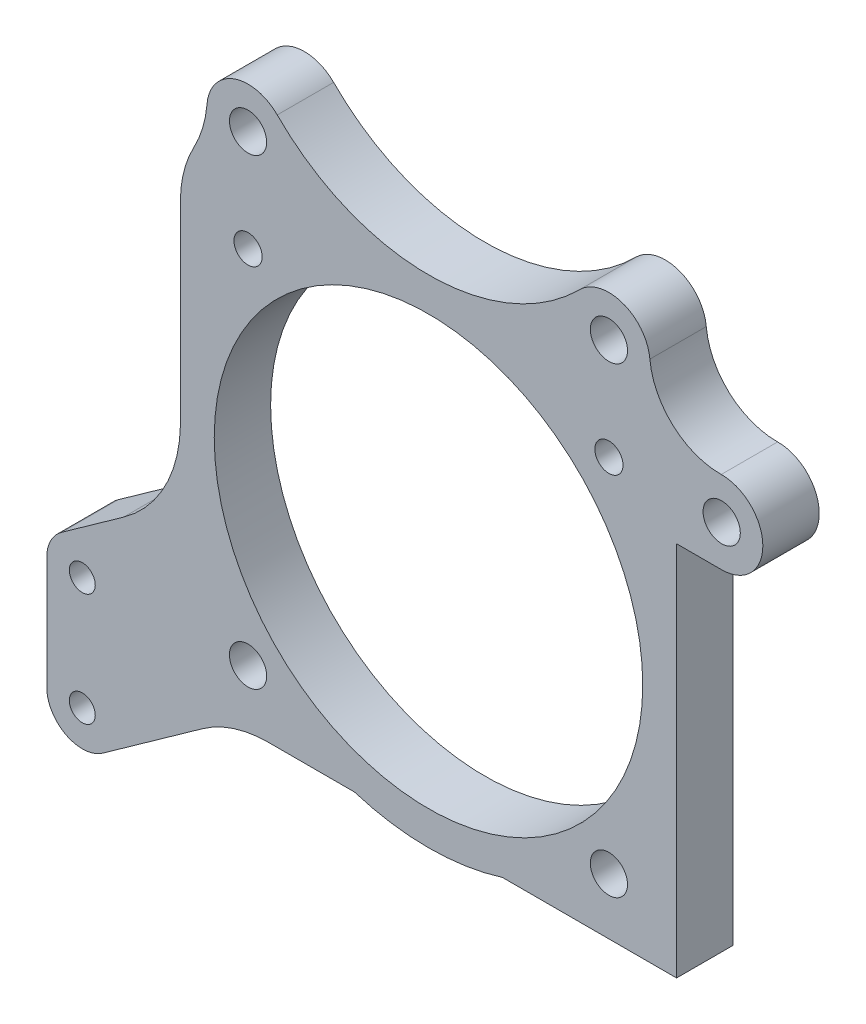
ISO-10303-21;
HEADER;
FILE_DESCRIPTION(('STEP AP214'),'2;1');
FILE_NAME('part.step','',(''),(''),'','','');
FILE_SCHEMA(('AUTOMOTIVE_DESIGN { 1 0 10303 214 1 1 1 1 }'));
ENDSEC;
DATA;
#1=APPLICATION_CONTEXT('core data for automotive mechanical design processes');
#2=APPLICATION_PROTOCOL_DEFINITION('international standard','automotive_design',2000,#1);
#3=PRODUCT_CONTEXT('',#1,'mechanical');
#4=PRODUCT('Part','Part','',(#3));
#5=PRODUCT_RELATED_PRODUCT_CATEGORY('part','',(#4));
#6=PRODUCT_DEFINITION_FORMATION('','',#4);
#7=PRODUCT_DEFINITION_CONTEXT('part definition',#1,'design');
#8=PRODUCT_DEFINITION('design','',#6,#7);
#9=PRODUCT_DEFINITION_SHAPE('','',#8);
#10=(LENGTH_UNIT() NAMED_UNIT(*) SI_UNIT(.MILLI.,.METRE.));
#11=(NAMED_UNIT(*) PLANE_ANGLE_UNIT() SI_UNIT($,.RADIAN.));
#12=(NAMED_UNIT(*) SI_UNIT($,.STERADIAN.) SOLID_ANGLE_UNIT());
#13=UNCERTAINTY_MEASURE_WITH_UNIT(LENGTH_MEASURE(1.E-05),#10,'distance_accuracy_value','');
#14=(GEOMETRIC_REPRESENTATION_CONTEXT(3) GLOBAL_UNCERTAINTY_ASSIGNED_CONTEXT((#13)) GLOBAL_UNIT_ASSIGNED_CONTEXT((#10,
#11,#12)) REPRESENTATION_CONTEXT('',''));
#15=CARTESIAN_POINT('',(0.,0.,0.));
#16=DIRECTION('',(0.,0.,1.));
#17=DIRECTION('',(1.,0.,0.));
#18=AXIS2_PLACEMENT_3D('',#15,#16,#17);
#19=CARTESIAN_POINT('',(-20.2380952380952,-21.,45.7173028644093));
#20=DIRECTION('',(-1.,0.,0.));
#21=DIRECTION('',(0.,0.,1.));
#22=AXIS2_PLACEMENT_3D('',#19,#20,#21);
#23=PLANE('',#22);
#24=DIRECTION('',(0.,1.,0.));
#25=VECTOR('',#24,1.);
#26=CARTESIAN_POINT('',(-20.2380952380952,-21.,0.));
#27=LINE('',#26,#25);
#28=CARTESIAN_POINT('',(-20.2380952380952,-0.558456175241286,0.));
#29=VERTEX_POINT('',#28);
#30=CARTESIAN_POINT('',(-20.2380952380952,16.6503890181125,0.));
#31=VERTEX_POINT('',#30);
#32=EDGE_CURVE('E228',#29,#31,#27,.T.);
#33=ORIENTED_EDGE('',*,*,#32,.F.);
#34=DIRECTION('',(0.,0.,1.));
#35=VECTOR('',#34,1.);
#36=CARTESIAN_POINT('',(-20.2380952380952,-0.558456175241278,-35.1845806434157));
#37=LINE('',#36,#35);
#38=CARTESIAN_POINT('',(-20.2380952380952,-0.558456175241278,5.));
#39=VERTEX_POINT('',#38);
#40=EDGE_CURVE('E53',#29,#39,#37,.T.);
#41=ORIENTED_EDGE('',*,*,#40,.T.);
#42=DIRECTION('',(0.,1.,0.));
#43=VECTOR('',#42,1.);
#44=CARTESIAN_POINT('',(-20.2380952380952,-21.,5.));
#45=LINE('',#44,#43);
#46=CARTESIAN_POINT('',(-20.2380952380952,16.6503890181126,5.));
#47=VERTEX_POINT('',#46);
#48=EDGE_CURVE('E230',#39,#47,#45,.T.);
#49=ORIENTED_EDGE('',*,*,#48,.T.);
#50=DIRECTION('',(0.,0.,-1.));
#51=VECTOR('',#50,1.);
#52=CARTESIAN_POINT('',(-20.2380952380952,16.6503890181126,0.));
#53=LINE('',#52,#51);
#54=EDGE_CURVE('E359',#47,#31,#53,.T.);
#55=ORIENTED_EDGE('',*,*,#54,.T.);
#56=EDGE_LOOP('',(#33,#41,#49,#55));
#57=FACE_BOUND('',#56,.T.);
#58=ADVANCED_FACE('F38',(#57),#23,.T.);
#59=CARTESIAN_POINT('',(-17.8880952380952,-21.,17.));
#60=DIRECTION('',(0.,1.,0.));
#61=DIRECTION('',(0.,0.,1.));
#62=AXIS2_PLACEMENT_3D('',#59,#60,#61);
#63=PLANE('',#62);
#64=DIRECTION('',(1.,0.,0.));
#65=VECTOR('',#64,1.);
#66=CARTESIAN_POINT('',(-17.8880952380952,-21.,5.));
#67=LINE('',#66,#65);
#68=CARTESIAN_POINT('',(-12.4460870876995,-21.,5.));
#69=VERTEX_POINT('',#68);
#70=CARTESIAN_POINT('',(-4.79553376239723,-21.,5.));
#71=VERTEX_POINT('',#70);
#72=EDGE_CURVE('E275',#69,#71,#67,.T.);
#73=ORIENTED_EDGE('',*,*,#72,.F.);
#74=DIRECTION('',(0.,0.,1.));
#75=VECTOR('',#74,1.);
#76=CARTESIAN_POINT('',(-12.4460870876995,-21.,-35.1845806434157));
#77=LINE('',#76,#75);
#78=CARTESIAN_POINT('',(-12.4460870876995,-21.,0.));
#79=VERTEX_POINT('',#78);
#80=EDGE_CURVE('E219',#79,#69,#77,.T.);
#81=ORIENTED_EDGE('',*,*,#80,.F.);
#82=DIRECTION('',(1.,0.,0.));
#83=VECTOR('',#82,1.);
#84=CARTESIAN_POINT('',(-17.8880952380952,-21.,0.));
#85=LINE('',#84,#83);
#86=CARTESIAN_POINT('',(-4.79553376239723,-21.,0.));
#87=VERTEX_POINT('',#86);
#88=EDGE_CURVE('E303',#79,#87,#85,.T.);
#89=ORIENTED_EDGE('',*,*,#88,.T.);
#90=DIRECTION('',(0.,0.,-1.));
#91=VECTOR('',#90,1.);
#92=CARTESIAN_POINT('',(-4.79553376239723,-21.,17.));
#93=LINE('',#92,#91);
#94=EDGE_CURVE('E348',#71,#87,#93,.T.);
#95=ORIENTED_EDGE('',*,*,#94,.F.);
#96=EDGE_LOOP('',(#73,#81,#89,#95));
#97=FACE_BOUND('',#96,.T.);
#98=ADVANCED_FACE('F423',(#97),#63,.F.);
#99=CARTESIAN_POINT('',(8.31934328620676,-21.,17.));
#100=DIRECTION('',(0.,1.,0.));
#101=DIRECTION('',(0.,0.,1.));
#102=AXIS2_PLACEMENT_3D('',#99,#100,#101);
#103=PLANE('',#102);
#104=DIRECTION('',(0.,0.,-1.));
#105=VECTOR('',#104,1.);
#106=CARTESIAN_POINT('',(23.7619047619048,-21.,17.));
#107=LINE('',#106,#105);
#108=CARTESIAN_POINT('',(23.7619047619048,-21.,5.));
#109=VERTEX_POINT('',#108);
#110=CARTESIAN_POINT('',(23.7619047619048,-21.,0.));
#111=VERTEX_POINT('',#110);
#112=EDGE_CURVE('E344',#109,#111,#107,.T.);
#113=ORIENTED_EDGE('',*,*,#112,.F.);
#114=DIRECTION('',(1.,0.,0.));
#115=VECTOR('',#114,1.);
#116=CARTESIAN_POINT('',(8.31934328620676,-21.,5.));
#117=LINE('',#116,#115);
#118=CARTESIAN_POINT('',(8.31934328620676,-21.,5.));
#119=VERTEX_POINT('',#118);
#120=EDGE_CURVE('E271',#119,#109,#117,.T.);
#121=ORIENTED_EDGE('',*,*,#120,.F.);
#122=DIRECTION('',(0.,0.,-1.));
#123=VECTOR('',#122,1.);
#124=CARTESIAN_POINT('',(8.31934328620676,-21.,17.));
#125=LINE('',#124,#123);
#126=CARTESIAN_POINT('',(8.31934328620676,-21.,0.));
#127=VERTEX_POINT('',#126);
#128=EDGE_CURVE('E346',#119,#127,#125,.T.);
#129=ORIENTED_EDGE('',*,*,#128,.T.);
#130=DIRECTION('',(1.,0.,0.));
#131=VECTOR('',#130,1.);
#132=CARTESIAN_POINT('',(8.31934328620676,-21.,0.));
#133=LINE('',#132,#131);
#134=EDGE_CURVE('E308',#127,#111,#133,.T.);
#135=ORIENTED_EDGE('',*,*,#134,.T.);
#136=EDGE_LOOP('',(#113,#121,#129,#135));
#137=FACE_BOUND('',#136,.T.);
#138=ADVANCED_FACE('F414',(#137),#103,.F.);
#139=CARTESIAN_POINT('',(23.7619047619048,-21.,17.));
#140=DIRECTION('',(-1.,0.,0.));
#141=DIRECTION('',(0.,-1.,0.));
#142=AXIS2_PLACEMENT_3D('',#139,#140,#141);
#143=PLANE('',#142);
#144=DIRECTION('',(0.,1.,0.));
#145=VECTOR('',#144,1.);
#146=CARTESIAN_POINT('',(23.7619047619048,-21.,5.));
#147=LINE('',#146,#145);
#148=CARTESIAN_POINT('',(23.7619047619048,12.35,5.));
#149=VERTEX_POINT('',#148);
#150=EDGE_CURVE('E232',#109,#149,#147,.T.);
#151=ORIENTED_EDGE('',*,*,#150,.F.);
#152=ORIENTED_EDGE('',*,*,#112,.T.);
#153=DIRECTION('',(0.,1.,0.));
#154=VECTOR('',#153,1.);
#155=CARTESIAN_POINT('',(23.7619047619048,-21.,0.));
#156=LINE('',#155,#154);
#157=CARTESIAN_POINT('',(23.7619047619048,12.35,0.));
#158=VERTEX_POINT('',#157);
#159=EDGE_CURVE('E311',#111,#158,#156,.T.);
#160=ORIENTED_EDGE('',*,*,#159,.T.);
#161=DIRECTION('',(0.,0.,-1.));
#162=VECTOR('',#161,1.);
#163=CARTESIAN_POINT('',(23.7619047619048,12.35,17.));
#164=LINE('',#163,#162);
#165=EDGE_CURVE('E342',#149,#158,#164,.T.);
#166=ORIENTED_EDGE('',*,*,#165,.F.);
#167=EDGE_LOOP('',(#151,#152,#160,#166));
#168=FACE_BOUND('',#167,.T.);
#169=ADVANCED_FACE('F410',(#168),#143,.F.);
#170=CARTESIAN_POINT('',(1.76190476190476,0.,17.));
#171=DIRECTION('',(0.,0.,-1.));
#172=DIRECTION('',(-1.,0.,0.));
#173=AXIS2_PLACEMENT_3D('',#170,#171,#172);
#174=CYLINDRICAL_SURFACE('',#173,22.);
#175=CARTESIAN_POINT('',(1.76190476190476,0.,5.));
#176=DIRECTION('',(0.,0.,1.));
#177=DIRECTION('',(1.,0.,0.));
#178=AXIS2_PLACEMENT_3D('',#175,#176,#177);
#179=CIRCLE('',#178,22.);
#180=EDGE_CURVE('E273',#71,#119,#179,.T.);
#181=ORIENTED_EDGE('',*,*,#180,.F.);
#182=ORIENTED_EDGE('',*,*,#94,.T.);
#183=CARTESIAN_POINT('',(1.76190476190476,0.,0.));
#184=DIRECTION('',(0.,0.,1.));
#185=DIRECTION('',(1.,0.,0.));
#186=AXIS2_PLACEMENT_3D('',#183,#184,#185);
#187=CIRCLE('',#186,22.);
#188=EDGE_CURVE('E305',#87,#127,#187,.T.);
#189=ORIENTED_EDGE('',*,*,#188,.T.);
#190=ORIENTED_EDGE('',*,*,#128,.F.);
#191=EDGE_LOOP('',(#181,#182,#189,#190));
#192=FACE_BOUND('',#191,.T.);
#193=ADVANCED_FACE('F419',(#192),#174,.T.);
#194=CARTESIAN_POINT('',(23.7619047619048,12.35,17.));
#195=DIRECTION('',(0.,1.,0.));
#196=DIRECTION('',(0.,0.,1.));
#197=AXIS2_PLACEMENT_3D('',#194,#195,#196);
#198=PLANE('',#197);
#199=DIRECTION('',(1.,0.,0.));
#200=VECTOR('',#199,1.);
#201=CARTESIAN_POINT('',(23.7619047619048,12.35,5.));
#202=LINE('',#201,#200);
#203=CARTESIAN_POINT('',(27.7619047619048,12.35,5.));
#204=VERTEX_POINT('',#203);
#205=EDGE_CURVE('E269',#149,#204,#202,.T.);
#206=ORIENTED_EDGE('',*,*,#205,.F.);
#207=ORIENTED_EDGE('',*,*,#165,.T.);
#208=DIRECTION('',(1.,0.,0.));
#209=VECTOR('',#208,1.);
#210=CARTESIAN_POINT('',(23.7619047619048,12.35,0.));
#211=LINE('',#210,#209);
#212=CARTESIAN_POINT('',(27.7619047619048,12.35,0.));
#213=VERTEX_POINT('',#212);
#214=EDGE_CURVE('E314',#158,#213,#211,.T.);
#215=ORIENTED_EDGE('',*,*,#214,.T.);
#216=DIRECTION('',(0.,0.,-1.));
#217=VECTOR('',#216,1.);
#218=CARTESIAN_POINT('',(27.7619047619048,12.35,17.));
#219=LINE('',#218,#217);
#220=EDGE_CURVE('E340',#204,#213,#219,.T.);
#221=ORIENTED_EDGE('',*,*,#220,.F.);
#222=EDGE_LOOP('',(#206,#207,#215,#221));
#223=FACE_BOUND('',#222,.T.);
#224=ADVANCED_FACE('F406',(#223),#198,.F.);
#225=CARTESIAN_POINT('',(27.7619047619048,16.,17.));
#226=DIRECTION('',(0.,0.,-1.));
#227=DIRECTION('',(-1.,0.,0.));
#228=AXIS2_PLACEMENT_3D('',#225,#226,#227);
#229=CYLINDRICAL_SURFACE('',#228,3.65);
#230=CARTESIAN_POINT('',(27.7619047619048,16.,5.));
#231=DIRECTION('',(0.,0.,1.));
#232=DIRECTION('',(1.,0.,0.));
#233=AXIS2_PLACEMENT_3D('',#230,#231,#232);
#234=CIRCLE('',#233,3.65);
#235=CARTESIAN_POINT('',(27.7228519117956,19.6497910727737,5.));
#236=VERTEX_POINT('',#235);
#237=EDGE_CURVE('E267',#204,#236,#234,.T.);
#238=ORIENTED_EDGE('',*,*,#237,.F.);
#239=ORIENTED_EDGE('',*,*,#220,.T.);
#240=CARTESIAN_POINT('',(27.7619047619048,16.,0.));
#241=DIRECTION('',(0.,0.,1.));
#242=DIRECTION('',(-1.,0.,0.));
#243=AXIS2_PLACEMENT_3D('',#240,#241,#242);
#244=CIRCLE('',#243,3.65);
#245=CARTESIAN_POINT('',(27.7228519117956,19.6497910727737,0.));
#246=VERTEX_POINT('',#245);
#247=EDGE_CURVE('E317',#213,#246,#244,.T.);
#248=ORIENTED_EDGE('',*,*,#247,.T.);
#249=DIRECTION('',(0.,0.,-1.));
#250=VECTOR('',#249,1.);
#251=CARTESIAN_POINT('',(27.7228519117956,19.6497910727737,17.));
#252=LINE('',#251,#250);
#253=EDGE_CURVE('E338',#236,#246,#252,.T.);
#254=ORIENTED_EDGE('',*,*,#253,.F.);
#255=EDGE_LOOP('',(#238,#239,#248,#254));
#256=FACE_BOUND('',#255,.T.);
#257=ADVANCED_FACE('F399',(#256),#229,.T.);
#258=CARTESIAN_POINT('',(27.6555742361179,25.9374105269034,17.));
#259=DIRECTION('',(0.,0.,-1.));
#260=DIRECTION('',(-1.,0.,0.));
#261=AXIS2_PLACEMENT_3D('',#258,#259,#260);
#262=CYLINDRICAL_SURFACE('',#261,6.28797938018214);
#263=DIRECTION('',(0.,0.,-1.));
#264=VECTOR('',#263,1.);
#265=CARTESIAN_POINT('',(21.3956307135696,25.3442901511771,17.));
#266=LINE('',#265,#264);
#267=CARTESIAN_POINT('',(21.3956307135696,25.3442901511771,5.));
#268=VERTEX_POINT('',#267);
#269=CARTESIAN_POINT('',(21.3956307135696,25.3442901511771,0.));
#270=VERTEX_POINT('',#269);
#271=EDGE_CURVE('E336',#268,#270,#266,.T.);
#272=ORIENTED_EDGE('',*,*,#271,.F.);
#273=CARTESIAN_POINT('',(27.6555742361179,25.9374105269034,5.));
#274=DIRECTION('',(0.,0.,1.));
#275=DIRECTION('',(1.,0.,0.));
#276=AXIS2_PLACEMENT_3D('',#273,#274,#275);
#277=CIRCLE('',#276,6.28797938018214);
#278=EDGE_CURVE('E265',#236,#268,#277,.F.);
#279=ORIENTED_EDGE('',*,*,#278,.F.);
#280=ORIENTED_EDGE('',*,*,#253,.T.);
#281=CARTESIAN_POINT('',(27.6555742361179,25.9374105269034,0.));
#282=DIRECTION('',(0.,0.,-1.));
#283=DIRECTION('',(-1.,0.,0.));
#284=AXIS2_PLACEMENT_3D('',#281,#282,#283);
#285=CIRCLE('',#284,6.28797938018214);
#286=EDGE_CURVE('E320',#246,#270,#285,.T.);
#287=ORIENTED_EDGE('',*,*,#286,.T.);
#288=EDGE_LOOP('',(#272,#279,#280,#287));
#289=FACE_BOUND('',#288,.T.);
#290=ADVANCED_FACE('F395',(#289),#262,.F.);
#291=CARTESIAN_POINT('',(17.7619047619048,25.,17.));
#292=DIRECTION('',(0.,0.,-1.));
#293=DIRECTION('',(-1.,0.,0.));
#294=AXIS2_PLACEMENT_3D('',#291,#292,#293);
#295=CYLINDRICAL_SURFACE('',#294,3.65);
#296=CARTESIAN_POINT('',(17.7619047619048,25.,5.));
#297=DIRECTION('',(0.,0.,1.));
#298=DIRECTION('',(1.,0.,0.));
#299=AXIS2_PLACEMENT_3D('',#296,#297,#298);
#300=CIRCLE('',#299,3.65);
#301=CARTESIAN_POINT('',(15.1747568965716,27.5747166684709,5.));
#302=VERTEX_POINT('',#301);
#303=EDGE_CURVE('E263',#268,#302,#300,.T.);
#304=ORIENTED_EDGE('',*,*,#303,.F.);
#305=ORIENTED_EDGE('',*,*,#271,.T.);
#306=CARTESIAN_POINT('',(17.7619047619048,25.,0.));
#307=DIRECTION('',(0.,0.,1.));
#308=DIRECTION('',(-1.,0.,0.));
#309=AXIS2_PLACEMENT_3D('',#306,#307,#308);
#310=CIRCLE('',#309,3.65);
#311=CARTESIAN_POINT('',(15.1747568965716,27.5747166684709,0.));
#312=VERTEX_POINT('',#311);
#313=EDGE_CURVE('E323',#270,#312,#310,.T.);
#314=ORIENTED_EDGE('',*,*,#313,.T.);
#315=DIRECTION('',(0.,0.,-1.));
#316=VECTOR('',#315,1.);
#317=CARTESIAN_POINT('',(15.1747568965716,27.5747166684709,17.));
#318=LINE('',#317,#316);
#319=EDGE_CURVE('E334',#302,#312,#318,.T.);
#320=ORIENTED_EDGE('',*,*,#319,.F.);
#321=EDGE_LOOP('',(#304,#305,#314,#320));
#322=FACE_BOUND('',#321,.T.);
#323=ADVANCED_FACE('F391',(#322),#295,.T.);
#324=CARTESIAN_POINT('',(1.76190476190476,40.9231203007519,17.));
#325=DIRECTION('',(0.,0.,-1.));
#326=DIRECTION('',(-1.,0.,0.));
#327=AXIS2_PLACEMENT_3D('',#324,#325,#326);
#328=CYLINDRICAL_SURFACE('',#327,18.9231203007519);
#329=CARTESIAN_POINT('',(1.76190476190476,40.9231203007519,5.));
#330=DIRECTION('',(0.,0.,1.));
#331=DIRECTION('',(1.,0.,0.));
#332=AXIS2_PLACEMENT_3D('',#329,#330,#331);
#333=CIRCLE('',#332,18.9231203007519);
#334=CARTESIAN_POINT('',(-11.650947372762,27.5747166684709,5.));
#335=VERTEX_POINT('',#334);
#336=EDGE_CURVE('E261',#302,#335,#333,.F.);
#337=ORIENTED_EDGE('',*,*,#336,.F.);
#338=ORIENTED_EDGE('',*,*,#319,.T.);
#339=CARTESIAN_POINT('',(1.76190476190476,40.9231203007519,0.));
#340=DIRECTION('',(0.,0.,-1.));
#341=DIRECTION('',(-1.,0.,0.));
#342=AXIS2_PLACEMENT_3D('',#339,#340,#341);
#343=CIRCLE('',#342,18.9231203007519);
#344=CARTESIAN_POINT('',(-11.650947372762,27.5747166684709,0.));
#345=VERTEX_POINT('',#344);
#346=EDGE_CURVE('E326',#312,#345,#343,.T.);
#347=ORIENTED_EDGE('',*,*,#346,.T.);
#348=DIRECTION('',(0.,0.,-1.));
#349=VECTOR('',#348,1.);
#350=CARTESIAN_POINT('',(-11.650947372762,27.5747166684709,17.));
#351=LINE('',#350,#349);
#352=EDGE_CURVE('E332',#335,#345,#351,.T.);
#353=ORIENTED_EDGE('',*,*,#352,.F.);
#354=EDGE_LOOP('',(#337,#338,#347,#353));
#355=FACE_BOUND('',#354,.T.);
#356=ADVANCED_FACE('F383',(#355),#328,.F.);
#357=CARTESIAN_POINT('',(-14.2380952380952,25.,17.));
#358=DIRECTION('',(0.,0.,-1.));
#359=DIRECTION('',(-1.,0.,0.));
#360=AXIS2_PLACEMENT_3D('',#357,#358,#359);
#361=CYLINDRICAL_SURFACE('',#360,3.65);
#362=CARTESIAN_POINT('',(-14.2380952380952,25.,0.));
#363=DIRECTION('',(0.,0.,1.));
#364=DIRECTION('',(-1.,0.,0.));
#365=AXIS2_PLACEMENT_3D('',#362,#363,#364);
#366=CIRCLE('',#365,3.65);
#367=CARTESIAN_POINT('',(-17.8751950900905,25.3066018046526,0.));
#368=VERTEX_POINT('',#367);
#369=EDGE_CURVE('E329',#345,#368,#366,.T.);
#370=ORIENTED_EDGE('',*,*,#369,.T.);
#371=DIRECTION('',(0.,0.,-1.));
#372=VECTOR('',#371,1.);
#373=CARTESIAN_POINT('',(-17.8751950900905,25.3066018046526,17.));
#374=LINE('',#373,#372);
#375=CARTESIAN_POINT('',(-17.8751950900905,25.3066018046526,5.));
#376=VERTEX_POINT('',#375);
#377=EDGE_CURVE('E351',#368,#376,#374,.F.);
#378=ORIENTED_EDGE('',*,*,#377,.T.);
#379=CARTESIAN_POINT('',(-14.2380952380952,25.,5.));
#380=DIRECTION('',(0.,0.,1.));
#381=DIRECTION('',(1.,0.,0.));
#382=AXIS2_PLACEMENT_3D('',#379,#380,#381);
#383=CIRCLE('',#382,3.65);
#384=EDGE_CURVE('E258',#335,#376,#383,.T.);
#385=ORIENTED_EDGE('',*,*,#384,.F.);
#386=ORIENTED_EDGE('',*,*,#352,.T.);
#387=EDGE_LOOP('',(#370,#378,#385,#386));
#388=FACE_BOUND('',#387,.T.);
#389=ADVANCED_FACE('F381',(#388),#361,.T.);
#390=CARTESIAN_POINT('',(1.76190476190476,0.,17.));
#391=DIRECTION('',(0.,0.,-1.));
#392=DIRECTION('',(-1.,0.,0.));
#393=AXIS2_PLACEMENT_3D('',#390,#391,#392);
#394=CYLINDRICAL_SURFACE('',#393,19.);
#395=CARTESIAN_POINT('',(1.76190476190476,0.,0.));
#396=DIRECTION('',(0.,0.,1.));
#397=DIRECTION('',(1.,0.,0.));
#398=AXIS2_PLACEMENT_3D('',#395,#396,#397);
#399=CIRCLE('',#398,19.);
#400=CARTESIAN_POINT('',(20.7619047619048,0.,0.));
#401=VERTEX_POINT('',#400);
#402=EDGE_CURVE('E299',#401,#401,#399,.T.);
#403=ORIENTED_EDGE('',*,*,#402,.F.);
#404=EDGE_LOOP('',(#403));
#405=FACE_BOUND('',#404,.T.);
#406=CARTESIAN_POINT('',(1.76190476190476,0.,5.));
#407=DIRECTION('',(0.,0.,1.));
#408=DIRECTION('',(1.,0.,0.));
#409=AXIS2_PLACEMENT_3D('',#406,#407,#408);
#410=CIRCLE('',#409,19.);
#411=CARTESIAN_POINT('',(20.7619047619048,0.,5.));
#412=VERTEX_POINT('',#411);
#413=EDGE_CURVE('E254',#412,#412,#410,.T.);
#414=ORIENTED_EDGE('',*,*,#413,.T.);
#415=EDGE_LOOP('',(#414));
#416=FACE_BOUND('',#415,.T.);
#417=ADVANCED_FACE('F586',(#405,#416),#394,.F.);
#418=CARTESIAN_POINT('',(17.7619047619048,16.,17.));
#419=DIRECTION('',(0.,0.,-1.));
#420=DIRECTION('',(-1.,0.,0.));
#421=AXIS2_PLACEMENT_3D('',#418,#419,#420);
#422=CYLINDRICAL_SURFACE('',#421,1.25);
#423=CARTESIAN_POINT('',(17.7619047619048,16.,0.));
#424=DIRECTION('',(0.,0.,1.));
#425=DIRECTION('',(1.,0.,0.));
#426=AXIS2_PLACEMENT_3D('',#423,#424,#425);
#427=CIRCLE('',#426,1.25);
#428=CARTESIAN_POINT('',(19.0119047619048,16.,0.));
#429=VERTEX_POINT('',#428);
#430=EDGE_CURVE('E296',#429,#429,#427,.T.);
#431=ORIENTED_EDGE('',*,*,#430,.F.);
#432=EDGE_LOOP('',(#431));
#433=FACE_BOUND('',#432,.T.);
#434=CARTESIAN_POINT('',(17.7619047619048,16.,5.));
#435=DIRECTION('',(0.,0.,1.));
#436=DIRECTION('',(1.,0.,0.));
#437=AXIS2_PLACEMENT_3D('',#434,#435,#436);
#438=CIRCLE('',#437,1.25);
#439=CARTESIAN_POINT('',(19.0119047619048,16.,5.));
#440=VERTEX_POINT('',#439);
#441=EDGE_CURVE('E251',#440,#440,#438,.T.);
#442=ORIENTED_EDGE('',*,*,#441,.T.);
#443=EDGE_LOOP('',(#442));
#444=FACE_BOUND('',#443,.T.);
#445=ADVANCED_FACE('F597',(#433,#444),#422,.F.);
#446=CARTESIAN_POINT('',(-14.2380952380952,16.,17.));
#447=DIRECTION('',(0.,0.,-1.));
#448=DIRECTION('',(-1.,0.,0.));
#449=AXIS2_PLACEMENT_3D('',#446,#447,#448);
#450=CYLINDRICAL_SURFACE('',#449,1.25);
#451=CARTESIAN_POINT('',(-14.2380952380952,16.,0.));
#452=DIRECTION('',(0.,0.,1.));
#453=DIRECTION('',(1.,0.,0.));
#454=AXIS2_PLACEMENT_3D('',#451,#452,#453);
#455=CIRCLE('',#454,1.25);
#456=CARTESIAN_POINT('',(-12.9880952380952,16.,0.));
#457=VERTEX_POINT('',#456);
#458=EDGE_CURVE('E293',#457,#457,#455,.T.);
#459=ORIENTED_EDGE('',*,*,#458,.F.);
#460=EDGE_LOOP('',(#459));
#461=FACE_BOUND('',#460,.T.);
#462=CARTESIAN_POINT('',(-14.2380952380952,16.,5.));
#463=DIRECTION('',(0.,0.,1.));
#464=DIRECTION('',(1.,0.,0.));
#465=AXIS2_PLACEMENT_3D('',#462,#463,#464);
#466=CIRCLE('',#465,1.25);
#467=CARTESIAN_POINT('',(-12.9880952380952,16.,5.));
#468=VERTEX_POINT('',#467);
#469=EDGE_CURVE('E248',#468,#468,#466,.T.);
#470=ORIENTED_EDGE('',*,*,#469,.T.);
#471=EDGE_LOOP('',(#470));
#472=FACE_BOUND('',#471,.T.);
#473=ADVANCED_FACE('F688',(#461,#472),#450,.F.);
#474=CARTESIAN_POINT('',(-14.2380952380952,-16.,17.));
#475=DIRECTION('',(0.,0.,-1.));
#476=DIRECTION('',(-1.,0.,0.));
#477=AXIS2_PLACEMENT_3D('',#474,#475,#476);
#478=CYLINDRICAL_SURFACE('',#477,1.65);
#479=CARTESIAN_POINT('',(-14.2380952380952,-16.,0.));
#480=DIRECTION('',(0.,0.,1.));
#481=DIRECTION('',(1.,0.,0.));
#482=AXIS2_PLACEMENT_3D('',#479,#480,#481);
#483=CIRCLE('',#482,1.65);
#484=CARTESIAN_POINT('',(-12.5880952380952,-16.,0.));
#485=VERTEX_POINT('',#484);
#486=EDGE_CURVE('E289',#485,#485,#483,.T.);
#487=ORIENTED_EDGE('',*,*,#486,.F.);
#488=EDGE_LOOP('',(#487));
#489=FACE_BOUND('',#488,.T.);
#490=CARTESIAN_POINT('',(-14.2380952380952,-16.,5.));
#491=DIRECTION('',(0.,0.,1.));
#492=DIRECTION('',(1.,0.,0.));
#493=AXIS2_PLACEMENT_3D('',#490,#491,#492);
#494=CIRCLE('',#493,1.65);
#495=CARTESIAN_POINT('',(-12.5880952380952,-16.,5.));
#496=VERTEX_POINT('',#495);
#497=EDGE_CURVE('E244',#496,#496,#494,.T.);
#498=ORIENTED_EDGE('',*,*,#497,.T.);
#499=EDGE_LOOP('',(#498));
#500=FACE_BOUND('',#499,.T.);
#501=ADVANCED_FACE('F678',(#489,#500),#478,.F.);
#502=CARTESIAN_POINT('',(17.7619047619048,-16.,17.));
#503=DIRECTION('',(0.,0.,-1.));
#504=DIRECTION('',(-1.,0.,0.));
#505=AXIS2_PLACEMENT_3D('',#502,#503,#504);
#506=CYLINDRICAL_SURFACE('',#505,1.65);
#507=CARTESIAN_POINT('',(17.7619047619048,-16.,0.));
#508=DIRECTION('',(0.,0.,1.));
#509=DIRECTION('',(1.,0.,0.));
#510=AXIS2_PLACEMENT_3D('',#507,#508,#509);
#511=CIRCLE('',#510,1.65);
#512=CARTESIAN_POINT('',(19.4119047619048,-16.,0.));
#513=VERTEX_POINT('',#512);
#514=EDGE_CURVE('E286',#513,#513,#511,.T.);
#515=ORIENTED_EDGE('',*,*,#514,.F.);
#516=EDGE_LOOP('',(#515));
#517=FACE_BOUND('',#516,.T.);
#518=CARTESIAN_POINT('',(17.7619047619048,-16.,5.));
#519=DIRECTION('',(0.,0.,1.));
#520=DIRECTION('',(1.,0.,0.));
#521=AXIS2_PLACEMENT_3D('',#518,#519,#520);
#522=CIRCLE('',#521,1.65);
#523=CARTESIAN_POINT('',(19.4119047619048,-16.,5.));
#524=VERTEX_POINT('',#523);
#525=EDGE_CURVE('E241',#524,#524,#522,.T.);
#526=ORIENTED_EDGE('',*,*,#525,.T.);
#527=EDGE_LOOP('',(#526));
#528=FACE_BOUND('',#527,.T.);
#529=ADVANCED_FACE('F668',(#517,#528),#506,.F.);
#530=CARTESIAN_POINT('',(27.7619047619048,16.,17.));
#531=DIRECTION('',(0.,0.,-1.));
#532=DIRECTION('',(-1.,0.,0.));
#533=AXIS2_PLACEMENT_3D('',#530,#531,#532);
#534=CYLINDRICAL_SURFACE('',#533,1.65);
#535=CARTESIAN_POINT('',(27.7619047619048,16.,0.));
#536=DIRECTION('',(0.,0.,1.));
#537=DIRECTION('',(-1.,0.,0.));
#538=AXIS2_PLACEMENT_3D('',#535,#536,#537);
#539=CIRCLE('',#538,1.65);
#540=CARTESIAN_POINT('',(26.1119047619048,16.,0.));
#541=VERTEX_POINT('',#540);
#542=EDGE_CURVE('E283',#541,#541,#539,.T.);
#543=ORIENTED_EDGE('',*,*,#542,.F.);
#544=EDGE_LOOP('',(#543));
#545=FACE_BOUND('',#544,.T.);
#546=CARTESIAN_POINT('',(27.7619047619048,16.,5.));
#547=DIRECTION('',(0.,0.,1.));
#548=DIRECTION('',(1.,0.,0.));
#549=AXIS2_PLACEMENT_3D('',#546,#547,#548);
#550=CIRCLE('',#549,1.65);
#551=CARTESIAN_POINT('',(29.4119047619048,16.,5.));
#552=VERTEX_POINT('',#551);
#553=EDGE_CURVE('E238',#552,#552,#550,.T.);
#554=ORIENTED_EDGE('',*,*,#553,.T.);
#555=EDGE_LOOP('',(#554));
#556=FACE_BOUND('',#555,.T.);
#557=ADVANCED_FACE('F658',(#545,#556),#534,.F.);
#558=CARTESIAN_POINT('',(17.7619047619048,25.,17.));
#559=DIRECTION('',(0.,0.,-1.));
#560=DIRECTION('',(-1.,0.,0.));
#561=AXIS2_PLACEMENT_3D('',#558,#559,#560);
#562=CYLINDRICAL_SURFACE('',#561,1.65);
#563=CARTESIAN_POINT('',(17.7619047619048,25.,0.));
#564=DIRECTION('',(0.,0.,1.));
#565=DIRECTION('',(-1.,0.,0.));
#566=AXIS2_PLACEMENT_3D('',#563,#564,#565);
#567=CIRCLE('',#566,1.65);
#568=CARTESIAN_POINT('',(16.1119047619048,25.,0.));
#569=VERTEX_POINT('',#568);
#570=EDGE_CURVE('E280',#569,#569,#567,.T.);
#571=ORIENTED_EDGE('',*,*,#570,.F.);
#572=EDGE_LOOP('',(#571));
#573=FACE_BOUND('',#572,.T.);
#574=CARTESIAN_POINT('',(17.7619047619048,25.,5.));
#575=DIRECTION('',(0.,0.,1.));
#576=DIRECTION('',(1.,0.,0.));
#577=AXIS2_PLACEMENT_3D('',#574,#575,#576);
#578=CIRCLE('',#577,1.65);
#579=CARTESIAN_POINT('',(19.4119047619048,25.,5.));
#580=VERTEX_POINT('',#579);
#581=EDGE_CURVE('E235',#580,#580,#578,.T.);
#582=ORIENTED_EDGE('',*,*,#581,.T.);
#583=EDGE_LOOP('',(#582));
#584=FACE_BOUND('',#583,.T.);
#585=ADVANCED_FACE('F649',(#573,#584),#562,.F.);
#586=CARTESIAN_POINT('',(-14.2380952380952,25.,17.));
#587=DIRECTION('',(0.,0.,-1.));
#588=DIRECTION('',(-1.,0.,0.));
#589=AXIS2_PLACEMENT_3D('',#586,#587,#588);
#590=CYLINDRICAL_SURFACE('',#589,1.65);
#591=CARTESIAN_POINT('',(-14.2380952380952,25.,0.));
#592=DIRECTION('',(0.,0.,1.));
#593=DIRECTION('',(-1.,0.,0.));
#594=AXIS2_PLACEMENT_3D('',#591,#592,#593);
#595=CIRCLE('',#594,1.65);
#596=CARTESIAN_POINT('',(-15.8880952380952,25.,0.));
#597=VERTEX_POINT('',#596);
#598=EDGE_CURVE('E277',#597,#597,#595,.T.);
#599=ORIENTED_EDGE('',*,*,#598,.F.);
#600=EDGE_LOOP('',(#599));
#601=FACE_BOUND('',#600,.T.);
#602=CARTESIAN_POINT('',(-14.2380952380952,25.,5.));
#603=DIRECTION('',(0.,0.,1.));
#604=DIRECTION('',(1.,0.,0.));
#605=AXIS2_PLACEMENT_3D('',#602,#603,#604);
#606=CIRCLE('',#605,1.65);
#607=CARTESIAN_POINT('',(-12.5880952380952,25.,5.));
#608=VERTEX_POINT('',#607);
#609=EDGE_CURVE('E234',#608,#608,#606,.T.);
#610=ORIENTED_EDGE('',*,*,#609,.T.);
#611=EDGE_LOOP('',(#610));
#612=FACE_BOUND('',#611,.T.);
#613=ADVANCED_FACE('F452',(#601,#612),#590,.F.);
#614=CARTESIAN_POINT('',(1.76190476190476,0.,0.));
#615=DIRECTION('',(0.,0.,1.));
#616=DIRECTION('',(1.,0.,0.));
#617=AXIS2_PLACEMENT_3D('',#614,#615,#616);
#618=PLANE('',#617);
#619=ORIENTED_EDGE('',*,*,#88,.F.);
#620=CARTESIAN_POINT('',(-12.4460870876995,-31.,0.));
#621=DIRECTION('',(0.,0.,1.));
#622=DIRECTION('',(1.,0.,0.));
#623=AXIS2_PLACEMENT_3D('',#620,#621,#622);
#624=CIRCLE('',#623,10.);
#625=CARTESIAN_POINT('',(-18.2463287097038,-22.8540072964451,0.));
#626=VERTEX_POINT('',#625);
#627=EDGE_CURVE('E183',#79,#626,#624,.T.);
#628=ORIENTED_EDGE('',*,*,#627,.T.);
#629=DIRECTION('',(-0.81459927035549,-0.580024162200424,0.));
#630=VECTOR('',#629,1.);
#631=CARTESIAN_POINT('',(4.65965087242825,-6.54412082833158,0.));
#632=LINE('',#631,#630);
#633=CARTESIAN_POINT('',(-27.1110191271639,-29.1659877016198,0.));
#634=VERTEX_POINT('',#633);
#635=EDGE_CURVE('E176',#626,#634,#632,.T.);
#636=ORIENTED_EDGE('',*,*,#635,.T.);
#637=CARTESIAN_POINT('',(-28.9380952380952,-26.6,0.));
#638=DIRECTION('',(0.,0.,1.));
#639=DIRECTION('',(1.,0.,0.));
#640=AXIS2_PLACEMENT_3D('',#637,#638,#639);
#641=CIRCLE('',#640,3.15);
#642=CARTESIAN_POINT('',(-32.0880952380952,-26.6,0.));
#643=VERTEX_POINT('',#642);
#644=EDGE_CURVE('E181',#634,#643,#641,.F.);
#645=ORIENTED_EDGE('',*,*,#644,.T.);
#646=DIRECTION('',(0.,1.,0.));
#647=VECTOR('',#646,1.);
#648=CARTESIAN_POINT('',(-32.0880952380952,0.,0.));
#649=LINE('',#648,#647);
#650=CARTESIAN_POINT('',(-32.0880952380952,-16.6,0.));
#651=VERTEX_POINT('',#650);
#652=EDGE_CURVE('E196',#643,#651,#649,.T.);
#653=ORIENTED_EDGE('',*,*,#652,.T.);
#654=CARTESIAN_POINT('',(-28.9380952380952,-16.6,0.));
#655=DIRECTION('',(0.,0.,1.));
#656=DIRECTION('',(1.,0.,0.));
#657=AXIS2_PLACEMENT_3D('',#654,#655,#656);
#658=CIRCLE('',#657,3.15);
#659=CARTESIAN_POINT('',(-30.7651713490266,-14.0340122983802,0.));
#660=VERTEX_POINT('',#659);
#661=EDGE_CURVE('E223',#651,#660,#658,.F.);
#662=ORIENTED_EDGE('',*,*,#661,.T.);
#663=DIRECTION('',(0.81459927035549,0.580024162200424,0.));
#664=VECTOR('',#663,1.);
#665=CARTESIAN_POINT('',(-3.71937394260461,5.22357428754495,0.));
#666=LINE('',#665,#664);
#667=CARTESIAN_POINT('',(-25.2760003473441,-10.1255238829213,0.));
#668=VERTEX_POINT('',#667);
#669=EDGE_CURVE('E225',#660,#668,#666,.T.);
#670=ORIENTED_EDGE('',*,*,#669,.T.);
#671=CARTESIAN_POINT('',(-32.2362902937492,-0.350332638655394,0.));
#672=DIRECTION('',(0.,0.,1.));
#673=DIRECTION('',(1.,0.,0.));
#674=AXIS2_PLACEMENT_3D('',#671,#672,#673);
#675=CIRCLE('',#674,12.);
#676=EDGE_CURVE('E213',#29,#668,#675,.F.);
#677=ORIENTED_EDGE('',*,*,#676,.F.);
#678=ORIENTED_EDGE('',*,*,#32,.T.);
#679=CARTESIAN_POINT('',(-10.2380952380952,16.6503890181126,0.));
#680=DIRECTION('',(0.,0.,1.));
#681=DIRECTION('',(1.,0.,0.));
#682=AXIS2_PLACEMENT_3D('',#679,#680,#681);
#683=CIRCLE('',#682,10.);
#684=CARTESIAN_POINT('',(-19.0389737284699,21.3984978835095,0.));
#685=VERTEX_POINT('',#684);
#686=EDGE_CURVE('E362',#31,#685,#683,.F.);
#687=ORIENTED_EDGE('',*,*,#686,.T.);
#688=CARTESIAN_POINT('',(-27.8398522188445,26.1466067489064,0.));
#689=DIRECTION('',(0.,0.,1.));
#690=DIRECTION('',(1.,0.,0.));
#691=AXIS2_PLACEMENT_3D('',#688,#689,#690);
#692=CIRCLE('',#691,10.);
#693=EDGE_CURVE('E355',#685,#368,#692,.T.);
#694=ORIENTED_EDGE('',*,*,#693,.T.);
#695=ORIENTED_EDGE('',*,*,#369,.F.);
#696=ORIENTED_EDGE('',*,*,#346,.F.);
#697=ORIENTED_EDGE('',*,*,#313,.F.);
#698=ORIENTED_EDGE('',*,*,#286,.F.);
#699=ORIENTED_EDGE('',*,*,#247,.F.);
#700=ORIENTED_EDGE('',*,*,#214,.F.);
#701=ORIENTED_EDGE('',*,*,#159,.F.);
#702=ORIENTED_EDGE('',*,*,#134,.F.);
#703=ORIENTED_EDGE('',*,*,#188,.F.);
#704=EDGE_LOOP('',(#619,#628,#636,#645,#653,#662,#670,#677,#678,#687,#694,#695,#696,#697,#698,
#699,#700,#701,#702,#703));
#705=FACE_BOUND('',#704,.T.);
#706=ORIENTED_EDGE('',*,*,#570,.T.);
#707=EDGE_LOOP('',(#706));
#708=FACE_BOUND('',#707,.T.);
#709=ORIENTED_EDGE('',*,*,#514,.T.);
#710=EDGE_LOOP('',(#709));
#711=FACE_BOUND('',#710,.T.);
#712=ORIENTED_EDGE('',*,*,#458,.T.);
#713=EDGE_LOOP('',(#712));
#714=FACE_BOUND('',#713,.T.);
#715=ORIENTED_EDGE('',*,*,#402,.T.);
#716=EDGE_LOOP('',(#715));
#717=FACE_BOUND('',#716,.T.);
#718=ORIENTED_EDGE('',*,*,#430,.T.);
#719=EDGE_LOOP('',(#718));
#720=FACE_BOUND('',#719,.T.);
#721=ORIENTED_EDGE('',*,*,#486,.T.);
#722=EDGE_LOOP('',(#721));
#723=FACE_BOUND('',#722,.T.);
#724=ORIENTED_EDGE('',*,*,#542,.T.);
#725=EDGE_LOOP('',(#724));
#726=FACE_BOUND('',#725,.T.);
#727=ORIENTED_EDGE('',*,*,#598,.T.);
#728=EDGE_LOOP('',(#727));
#729=FACE_BOUND('',#728,.T.);
#730=CARTESIAN_POINT('',(-28.9380952380952,-16.6,0.));
#731=DIRECTION('',(0.,0.,1.));
#732=DIRECTION('',(1.,0.,0.));
#733=AXIS2_PLACEMENT_3D('',#730,#731,#732);
#734=CIRCLE('',#733,1.15);
#735=CARTESIAN_POINT('',(-27.7880952380952,-16.6,0.));
#736=VERTEX_POINT('',#735);
#737=EDGE_CURVE('E440',#736,#736,#734,.F.);
#738=ORIENTED_EDGE('',*,*,#737,.F.);
#739=EDGE_LOOP('',(#738));
#740=FACE_BOUND('',#739,.T.);
#741=CARTESIAN_POINT('',(-28.9380952380952,-26.6,0.));
#742=DIRECTION('',(0.,0.,1.));
#743=DIRECTION('',(1.,0.,0.));
#744=AXIS2_PLACEMENT_3D('',#741,#742,#743);
#745=CIRCLE('',#744,1.15);
#746=CARTESIAN_POINT('',(-27.7880952380952,-26.6,0.));
#747=VERTEX_POINT('',#746);
#748=EDGE_CURVE('E218',#747,#747,#745,.F.);
#749=ORIENTED_EDGE('',*,*,#748,.F.);
#750=EDGE_LOOP('',(#749));
#751=FACE_BOUND('',#750,.T.);
#752=ADVANCED_FACE('F179',(#705,#708,#711,#714,#717,#720,#723,#726,#729,#740,#751),#618,.F.);
#753=CARTESIAN_POINT('',(0.,0.,5.));
#754=DIRECTION('',(0.,0.,1.));
#755=DIRECTION('',(1.,0.,0.));
#756=AXIS2_PLACEMENT_3D('',#753,#754,#755);
#757=PLANE('',#756);
#758=CARTESIAN_POINT('',(-12.4460870876995,-31.,5.));
#759=DIRECTION('',(0.,0.,1.));
#760=DIRECTION('',(1.,0.,0.));
#761=AXIS2_PLACEMENT_3D('',#758,#759,#760);
#762=CIRCLE('',#761,10.);
#763=CARTESIAN_POINT('',(-18.2463287097038,-22.8540072964451,5.));
#764=VERTEX_POINT('',#763);
#765=EDGE_CURVE('E428',#764,#69,#762,.F.);
#766=ORIENTED_EDGE('',*,*,#765,.T.);
#767=ORIENTED_EDGE('',*,*,#72,.T.);
#768=ORIENTED_EDGE('',*,*,#180,.T.);
#769=ORIENTED_EDGE('',*,*,#120,.T.);
#770=ORIENTED_EDGE('',*,*,#150,.T.);
#771=ORIENTED_EDGE('',*,*,#205,.T.);
#772=ORIENTED_EDGE('',*,*,#237,.T.);
#773=ORIENTED_EDGE('',*,*,#278,.T.);
#774=ORIENTED_EDGE('',*,*,#303,.T.);
#775=ORIENTED_EDGE('',*,*,#336,.T.);
#776=ORIENTED_EDGE('',*,*,#384,.T.);
#777=CARTESIAN_POINT('',(-27.8398522188445,26.1466067489064,5.));
#778=DIRECTION('',(0.,0.,1.));
#779=DIRECTION('',(1.,0.,0.));
#780=AXIS2_PLACEMENT_3D('',#777,#778,#779);
#781=CIRCLE('',#780,10.);
#782=CARTESIAN_POINT('',(-19.0389737284699,21.3984978835095,5.));
#783=VERTEX_POINT('',#782);
#784=EDGE_CURVE('E357',#376,#783,#781,.F.);
#785=ORIENTED_EDGE('',*,*,#784,.T.);
#786=CARTESIAN_POINT('',(-10.2380952380952,16.6503890181126,5.));
#787=DIRECTION('',(0.,0.,1.));
#788=DIRECTION('',(1.,0.,0.));
#789=AXIS2_PLACEMENT_3D('',#786,#787,#788);
#790=CIRCLE('',#789,10.);
#791=EDGE_CURVE('E11',#783,#47,#790,.T.);
#792=ORIENTED_EDGE('',*,*,#791,.T.);
#793=ORIENTED_EDGE('',*,*,#48,.F.);
#794=CARTESIAN_POINT('',(-32.2362902937492,-0.350332638655394,5.));
#795=DIRECTION('',(0.,0.,1.));
#796=DIRECTION('',(1.,0.,0.));
#797=AXIS2_PLACEMENT_3D('',#794,#795,#796);
#798=CIRCLE('',#797,12.);
#799=CARTESIAN_POINT('',(-25.2760003473441,-10.1255238829213,5.));
#800=VERTEX_POINT('',#799);
#801=EDGE_CURVE('E216',#800,#39,#798,.T.);
#802=ORIENTED_EDGE('',*,*,#801,.F.);
#803=DIRECTION('',(-0.81459927035549,-0.580024162200424,0.));
#804=VECTOR('',#803,1.);
#805=CARTESIAN_POINT('',(-3.71937394260461,5.22357428754495,5.));
#806=LINE('',#805,#804);
#807=CARTESIAN_POINT('',(-30.7651713490266,-14.0340122983802,5.));
#808=VERTEX_POINT('',#807);
#809=EDGE_CURVE('E429',#800,#808,#806,.T.);
#810=ORIENTED_EDGE('',*,*,#809,.T.);
#811=CARTESIAN_POINT('',(-28.9380952380952,-16.6,5.));
#812=DIRECTION('',(0.,0.,1.));
#813=DIRECTION('',(1.,0.,0.));
#814=AXIS2_PLACEMENT_3D('',#811,#812,#813);
#815=CIRCLE('',#814,3.15);
#816=CARTESIAN_POINT('',(-32.0880952380952,-16.6,5.));
#817=VERTEX_POINT('',#816);
#818=EDGE_CURVE('E432',#808,#817,#815,.T.);
#819=ORIENTED_EDGE('',*,*,#818,.T.);
#820=DIRECTION('',(0.,-1.,0.));
#821=VECTOR('',#820,1.);
#822=CARTESIAN_POINT('',(-32.0880952380952,0.,5.));
#823=LINE('',#822,#821);
#824=CARTESIAN_POINT('',(-32.0880952380952,-26.6,5.));
#825=VERTEX_POINT('',#824);
#826=EDGE_CURVE('E815',#817,#825,#823,.T.);
#827=ORIENTED_EDGE('',*,*,#826,.T.);
#828=CARTESIAN_POINT('',(-28.9380952380952,-26.6,5.));
#829=DIRECTION('',(0.,0.,1.));
#830=DIRECTION('',(1.,0.,0.));
#831=AXIS2_PLACEMENT_3D('',#828,#829,#830);
#832=CIRCLE('',#831,3.15);
#833=CARTESIAN_POINT('',(-27.1110191271639,-29.1659877016198,5.));
#834=VERTEX_POINT('',#833);
#835=EDGE_CURVE('E187',#825,#834,#832,.T.);
#836=ORIENTED_EDGE('',*,*,#835,.T.);
#837=DIRECTION('',(0.81459927035549,0.580024162200424,0.));
#838=VECTOR('',#837,1.);
#839=CARTESIAN_POINT('',(4.65965087242825,-6.54412082833158,5.));
#840=LINE('',#839,#838);
#841=EDGE_CURVE('E200',#834,#764,#840,.T.);
#842=ORIENTED_EDGE('',*,*,#841,.T.);
#843=EDGE_LOOP('',(#766,#767,#768,#769,#770,#771,#772,#773,#774,#775,#776,#785,#792,#793,#802,
#810,#819,#827,#836,#842));
#844=FACE_BOUND('',#843,.T.);
#845=ORIENTED_EDGE('',*,*,#413,.F.);
#846=EDGE_LOOP('',(#845));
#847=FACE_BOUND('',#846,.T.);
#848=ORIENTED_EDGE('',*,*,#441,.F.);
#849=EDGE_LOOP('',(#848));
#850=FACE_BOUND('',#849,.T.);
#851=ORIENTED_EDGE('',*,*,#469,.F.);
#852=EDGE_LOOP('',(#851));
#853=FACE_BOUND('',#852,.T.);
#854=ORIENTED_EDGE('',*,*,#497,.F.);
#855=EDGE_LOOP('',(#854));
#856=FACE_BOUND('',#855,.T.);
#857=ORIENTED_EDGE('',*,*,#525,.F.);
#858=EDGE_LOOP('',(#857));
#859=FACE_BOUND('',#858,.T.);
#860=ORIENTED_EDGE('',*,*,#581,.F.);
#861=EDGE_LOOP('',(#860));
#862=FACE_BOUND('',#861,.T.);
#863=ORIENTED_EDGE('',*,*,#609,.F.);
#864=EDGE_LOOP('',(#863));
#865=FACE_BOUND('',#864,.T.);
#866=ORIENTED_EDGE('',*,*,#553,.F.);
#867=EDGE_LOOP('',(#866));
#868=FACE_BOUND('',#867,.T.);
#869=CARTESIAN_POINT('',(-28.9380952380952,-16.6,5.));
#870=DIRECTION('',(0.,0.,1.));
#871=DIRECTION('',(1.,0.,0.));
#872=AXIS2_PLACEMENT_3D('',#869,#870,#871);
#873=CIRCLE('',#872,1.15);
#874=CARTESIAN_POINT('',(-27.7880952380952,-16.6,5.));
#875=VERTEX_POINT('',#874);
#876=EDGE_CURVE('E220',#875,#875,#873,.T.);
#877=ORIENTED_EDGE('',*,*,#876,.F.);
#878=EDGE_LOOP('',(#877));
#879=FACE_BOUND('',#878,.T.);
#880=CARTESIAN_POINT('',(-28.9380952380952,-26.6,5.));
#881=DIRECTION('',(0.,0.,1.));
#882=DIRECTION('',(1.,0.,0.));
#883=AXIS2_PLACEMENT_3D('',#880,#881,#882);
#884=CIRCLE('',#883,1.15);
#885=CARTESIAN_POINT('',(-27.7880952380952,-26.6,5.));
#886=VERTEX_POINT('',#885);
#887=EDGE_CURVE('E437',#886,#886,#884,.T.);
#888=ORIENTED_EDGE('',*,*,#887,.F.);
#889=EDGE_LOOP('',(#888));
#890=FACE_BOUND('',#889,.T.);
#891=ADVANCED_FACE('F374',(#844,#847,#850,#853,#856,#859,#862,#865,#868,#879,#890),#757,.T.);
#892=CARTESIAN_POINT('',(-27.8398522188445,26.1466067489064,17.));
#893=DIRECTION('',(0.,0.,1.));
#894=DIRECTION('',(1.,0.,0.));
#895=AXIS2_PLACEMENT_3D('',#892,#893,#894);
#896=CYLINDRICAL_SURFACE('',#895,10.);
#897=ORIENTED_EDGE('',*,*,#693,.F.);
#898=DIRECTION('',(0.,0.,1.));
#899=VECTOR('',#898,1.);
#900=CARTESIAN_POINT('',(-19.0389737284699,21.3984978835095,17.));
#901=LINE('',#900,#899);
#902=EDGE_CURVE('E46',#685,#783,#901,.T.);
#903=ORIENTED_EDGE('',*,*,#902,.T.);
#904=ORIENTED_EDGE('',*,*,#784,.F.);
#905=ORIENTED_EDGE('',*,*,#377,.F.);
#906=EDGE_LOOP('',(#897,#903,#904,#905));
#907=FACE_BOUND('',#906,.T.);
#908=ADVANCED_FACE('F369',(#907),#896,.F.);
#909=CARTESIAN_POINT('',(-10.2380952380952,16.6503890181126,17.));
#910=DIRECTION('',(0.,0.,1.));
#911=DIRECTION('',(1.,0.,0.));
#912=AXIS2_PLACEMENT_3D('',#909,#910,#911);
#913=CYLINDRICAL_SURFACE('',#912,10.);
#914=ORIENTED_EDGE('',*,*,#791,.F.);
#915=ORIENTED_EDGE('',*,*,#902,.F.);
#916=ORIENTED_EDGE('',*,*,#686,.F.);
#917=ORIENTED_EDGE('',*,*,#54,.F.);
#918=EDGE_LOOP('',(#914,#915,#916,#917));
#919=FACE_BOUND('',#918,.T.);
#920=ADVANCED_FACE('F40',(#919),#913,.T.);
#921=CARTESIAN_POINT('',(4.65965087242825,-6.54412082833158,-35.1845806434157));
#922=DIRECTION('',(0.580024162200424,-0.814599270355489,0.));
#923=DIRECTION('',(0.81459927035549,0.580024162200424,0.));
#924=AXIS2_PLACEMENT_3D('',#921,#922,#923);
#925=PLANE('',#924);
#926=ORIENTED_EDGE('',*,*,#635,.F.);
#927=DIRECTION('',(0.,0.,1.));
#928=VECTOR('',#927,1.);
#929=CARTESIAN_POINT('',(-18.2463287097038,-22.8540072964451,-35.1845806434157));
#930=LINE('',#929,#928);
#931=EDGE_CURVE('E202',#626,#764,#930,.T.);
#932=ORIENTED_EDGE('',*,*,#931,.T.);
#933=ORIENTED_EDGE('',*,*,#841,.F.);
#934=DIRECTION('',(0.,0.,1.));
#935=VECTOR('',#934,1.);
#936=CARTESIAN_POINT('',(-27.1110191271639,-29.1659877016198,-35.1845806434157));
#937=LINE('',#936,#935);
#938=EDGE_CURVE('E193',#634,#834,#937,.T.);
#939=ORIENTED_EDGE('',*,*,#938,.F.);
#940=EDGE_LOOP('',(#926,#932,#933,#939));
#941=FACE_BOUND('',#940,.T.);
#942=ADVANCED_FACE('F198',(#941),#925,.T.);
#943=CARTESIAN_POINT('',(-28.9380952380952,-26.6,-35.1845806434157));
#944=DIRECTION('',(0.,0.,1.));
#945=DIRECTION('',(1.,0.,0.));
#946=AXIS2_PLACEMENT_3D('',#943,#944,#945);
#947=CYLINDRICAL_SURFACE('',#946,3.15);
#948=ORIENTED_EDGE('',*,*,#644,.F.);
#949=ORIENTED_EDGE('',*,*,#938,.T.);
#950=ORIENTED_EDGE('',*,*,#835,.F.);
#951=DIRECTION('',(0.,0.,1.));
#952=VECTOR('',#951,1.);
#953=CARTESIAN_POINT('',(-32.0880952380952,-26.6,-35.1845806434157));
#954=LINE('',#953,#952);
#955=EDGE_CURVE('E195',#643,#825,#954,.T.);
#956=ORIENTED_EDGE('',*,*,#955,.F.);
#957=EDGE_LOOP('',(#948,#949,#950,#956));
#958=FACE_BOUND('',#957,.T.);
#959=ADVANCED_FACE('F191',(#958),#947,.T.);
#960=CARTESIAN_POINT('',(-32.0880952380952,0.,-35.1845806434157));
#961=DIRECTION('',(-1.,0.,0.));
#962=DIRECTION('',(0.,0.,1.));
#963=AXIS2_PLACEMENT_3D('',#960,#961,#962);
#964=PLANE('',#963);
#965=ORIENTED_EDGE('',*,*,#652,.F.);
#966=ORIENTED_EDGE('',*,*,#955,.T.);
#967=ORIENTED_EDGE('',*,*,#826,.F.);
#968=DIRECTION('',(0.,0.,1.));
#969=VECTOR('',#968,1.);
#970=CARTESIAN_POINT('',(-32.0880952380952,-16.6,-35.1845806434157));
#971=LINE('',#970,#969);
#972=EDGE_CURVE('E204',#651,#817,#971,.T.);
#973=ORIENTED_EDGE('',*,*,#972,.F.);
#974=EDGE_LOOP('',(#965,#966,#967,#973));
#975=FACE_BOUND('',#974,.T.);
#976=ADVANCED_FACE('F481',(#975),#964,.T.);
#977=CARTESIAN_POINT('',(-28.9380952380952,-16.6,-35.1845806434157));
#978=DIRECTION('',(0.,0.,1.));
#979=DIRECTION('',(1.,0.,0.));
#980=AXIS2_PLACEMENT_3D('',#977,#978,#979);
#981=CYLINDRICAL_SURFACE('',#980,3.15);
#982=ORIENTED_EDGE('',*,*,#661,.F.);
#983=ORIENTED_EDGE('',*,*,#972,.T.);
#984=ORIENTED_EDGE('',*,*,#818,.F.);
#985=DIRECTION('',(0.,0.,1.));
#986=VECTOR('',#985,1.);
#987=CARTESIAN_POINT('',(-30.7651713490266,-14.0340122983802,-35.1845806434157));
#988=LINE('',#987,#986);
#989=EDGE_CURVE('E211',#660,#808,#988,.T.);
#990=ORIENTED_EDGE('',*,*,#989,.F.);
#991=EDGE_LOOP('',(#982,#983,#984,#990));
#992=FACE_BOUND('',#991,.T.);
#993=ADVANCED_FACE('F484',(#992),#981,.T.);
#994=CARTESIAN_POINT('',(-3.71937394260461,5.22357428754495,-35.1845806434157));
#995=DIRECTION('',(-0.580024162200424,0.81459927035549,0.));
#996=DIRECTION('',(-0.81459927035549,-0.580024162200424,0.));
#997=AXIS2_PLACEMENT_3D('',#994,#995,#996);
#998=PLANE('',#997);
#999=ORIENTED_EDGE('',*,*,#669,.F.);
#1000=ORIENTED_EDGE('',*,*,#989,.T.);
#1001=ORIENTED_EDGE('',*,*,#809,.F.);
#1002=DIRECTION('',(0.,0.,1.));
#1003=VECTOR('',#1002,1.);
#1004=CARTESIAN_POINT('',(-25.2760003473441,-10.1255238829213,-35.1845806434157));
#1005=LINE('',#1004,#1003);
#1006=EDGE_CURVE('E214',#668,#800,#1005,.T.);
#1007=ORIENTED_EDGE('',*,*,#1006,.F.);
#1008=EDGE_LOOP('',(#999,#1000,#1001,#1007));
#1009=FACE_BOUND('',#1008,.T.);
#1010=ADVANCED_FACE('F488',(#1009),#998,.T.);
#1011=CARTESIAN_POINT('',(-32.2362902937492,-0.350332638655394,-35.1845806434157));
#1012=DIRECTION('',(0.,0.,1.));
#1013=DIRECTION('',(1.,0.,0.));
#1014=AXIS2_PLACEMENT_3D('',#1011,#1012,#1013);
#1015=CYLINDRICAL_SURFACE('',#1014,12.);
#1016=ORIENTED_EDGE('',*,*,#40,.F.);
#1017=ORIENTED_EDGE('',*,*,#676,.T.);
#1018=ORIENTED_EDGE('',*,*,#1006,.T.);
#1019=ORIENTED_EDGE('',*,*,#801,.T.);
#1020=EDGE_LOOP('',(#1016,#1017,#1018,#1019));
#1021=FACE_BOUND('',#1020,.T.);
#1022=ADVANCED_FACE('F459',(#1021),#1015,.F.);
#1023=CARTESIAN_POINT('',(-28.9380952380952,-26.6,-35.1845806434157));
#1024=DIRECTION('',(0.,0.,1.));
#1025=DIRECTION('',(1.,0.,0.));
#1026=AXIS2_PLACEMENT_3D('',#1023,#1024,#1025);
#1027=CYLINDRICAL_SURFACE('',#1026,1.15);
#1028=ORIENTED_EDGE('',*,*,#748,.T.);
#1029=EDGE_LOOP('',(#1028));
#1030=FACE_BOUND('',#1029,.T.);
#1031=ORIENTED_EDGE('',*,*,#887,.T.);
#1032=EDGE_LOOP('',(#1031));
#1033=FACE_BOUND('',#1032,.T.);
#1034=ADVANCED_FACE('F456',(#1030,#1033),#1027,.F.);
#1035=CARTESIAN_POINT('',(-28.9380952380952,-16.6,-35.1845806434157));
#1036=DIRECTION('',(0.,0.,1.));
#1037=DIRECTION('',(1.,0.,0.));
#1038=AXIS2_PLACEMENT_3D('',#1035,#1036,#1037);
#1039=CYLINDRICAL_SURFACE('',#1038,1.15);
#1040=ORIENTED_EDGE('',*,*,#737,.T.);
#1041=EDGE_LOOP('',(#1040));
#1042=FACE_BOUND('',#1041,.T.);
#1043=ORIENTED_EDGE('',*,*,#876,.T.);
#1044=EDGE_LOOP('',(#1043));
#1045=FACE_BOUND('',#1044,.T.);
#1046=ADVANCED_FACE('F447',(#1042,#1045),#1039,.F.);
#1047=CARTESIAN_POINT('',(-12.4460870876995,-31.,-35.1845806434157));
#1048=DIRECTION('',(0.,0.,1.));
#1049=DIRECTION('',(1.,0.,0.));
#1050=AXIS2_PLACEMENT_3D('',#1047,#1048,#1049);
#1051=CYLINDRICAL_SURFACE('',#1050,10.);
#1052=ORIENTED_EDGE('',*,*,#627,.F.);
#1053=ORIENTED_EDGE('',*,*,#80,.T.);
#1054=ORIENTED_EDGE('',*,*,#765,.F.);
#1055=ORIENTED_EDGE('',*,*,#931,.F.);
#1056=EDGE_LOOP('',(#1052,#1053,#1054,#1055));
#1057=FACE_BOUND('',#1056,.T.);
#1058=ADVANCED_FACE('F427',(#1057),#1051,.F.);
#1059=CLOSED_SHELL('',(#58,#98,#138,#169,#193,#224,#257,#290,#323,#356,#389,#417,#445,#473,#501,
#529,#557,#585,#613,#752,#891,#908,#920,#942,#959,#976,#993,#1010,#1022,#1034,#1046,#1058));
#1060=MANIFOLD_SOLID_BREP('B2',#1059);
#1061=ADVANCED_BREP_SHAPE_REPRESENTATION('',(#18,#1060),#14);
#1062=SHAPE_DEFINITION_REPRESENTATION(#9,#1061);
ENDSEC;
END-ISO-10303-21;
